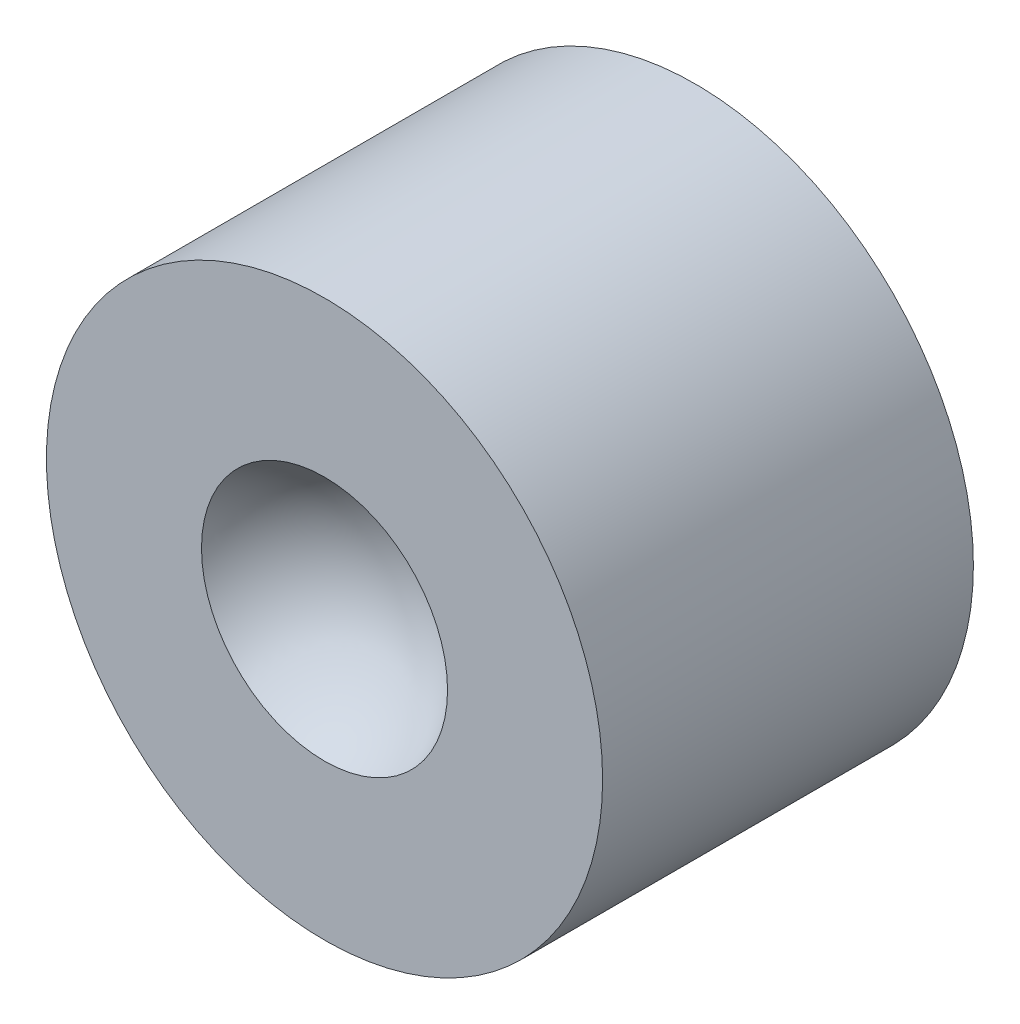
ISO-10303-21;
HEADER;
FILE_DESCRIPTION(('STEP AP214'),'2;1');
FILE_NAME('part.step','',(''),(''),'','','');
FILE_SCHEMA(('AUTOMOTIVE_DESIGN { 1 0 10303 214 1 1 1 1 }'));
ENDSEC;
DATA;
#1=APPLICATION_CONTEXT('core data for automotive mechanical design processes');
#2=APPLICATION_PROTOCOL_DEFINITION('international standard','automotive_design',2000,#1);
#3=PRODUCT_CONTEXT('',#1,'mechanical');
#4=PRODUCT('Part','Part','',(#3));
#5=PRODUCT_RELATED_PRODUCT_CATEGORY('part','',(#4));
#6=PRODUCT_DEFINITION_FORMATION('','',#4);
#7=PRODUCT_DEFINITION_CONTEXT('part definition',#1,'design');
#8=PRODUCT_DEFINITION('design','',#6,#7);
#9=PRODUCT_DEFINITION_SHAPE('','',#8);
#10=(LENGTH_UNIT() NAMED_UNIT(*) SI_UNIT(.MILLI.,.METRE.));
#11=(NAMED_UNIT(*) PLANE_ANGLE_UNIT() SI_UNIT($,.RADIAN.));
#12=(NAMED_UNIT(*) SI_UNIT($,.STERADIAN.) SOLID_ANGLE_UNIT());
#13=UNCERTAINTY_MEASURE_WITH_UNIT(LENGTH_MEASURE(1.E-05),#10,'distance_accuracy_value','');
#14=(GEOMETRIC_REPRESENTATION_CONTEXT(3) GLOBAL_UNCERTAINTY_ASSIGNED_CONTEXT((#13)) GLOBAL_UNIT_ASSIGNED_CONTEXT((#10,
#11,#12)) REPRESENTATION_CONTEXT('',''));
#15=CARTESIAN_POINT('',(0.,0.,0.));
#16=DIRECTION('',(0.,0.,1.));
#17=DIRECTION('',(1.,0.,0.));
#18=AXIS2_PLACEMENT_3D('',#15,#16,#17);
#19=CARTESIAN_POINT('',(0.,0.,6.35));
#20=DIRECTION('',(0.,0.,1.));
#21=DIRECTION('',(1.,0.,0.));
#22=AXIS2_PLACEMENT_3D('',#19,#20,#21);
#23=PLANE('',#22);
#24=CARTESIAN_POINT('',(0.,0.,6.35));
#25=DIRECTION('',(0.,0.,1.));
#26=DIRECTION('',(1.,0.,0.));
#27=AXIS2_PLACEMENT_3D('',#24,#25,#26);
#28=CIRCLE('',#27,4.7625);
#29=CARTESIAN_POINT('',(4.7625,0.,6.35));
#30=VERTEX_POINT('',#29);
#31=EDGE_CURVE('E11',#30,#30,#28,.T.);
#32=ORIENTED_EDGE('',*,*,#31,.T.);
#33=EDGE_LOOP('',(#32));
#34=FACE_BOUND('',#33,.T.);
#35=CARTESIAN_POINT('',(0.,0.,6.35));
#36=DIRECTION('',(0.,0.,-1.));
#37=DIRECTION('',(-1.,0.,0.));
#38=AXIS2_PLACEMENT_3D('',#35,#36,#37);
#39=CIRCLE('',#38,2.10693);
#40=CARTESIAN_POINT('',(-2.10693,0.,6.35));
#41=VERTEX_POINT('',#40);
#42=EDGE_CURVE('E49',#41,#41,#39,.T.);
#43=ORIENTED_EDGE('',*,*,#42,.T.);
#44=EDGE_LOOP('',(#43));
#45=FACE_BOUND('',#44,.T.);
#46=ADVANCED_FACE('F32',(#34,#45),#23,.T.);
#47=CARTESIAN_POINT('',(0.,0.,6.35));
#48=DIRECTION('',(0.,0.,-1.));
#49=DIRECTION('',(-1.,0.,0.));
#50=AXIS2_PLACEMENT_3D('',#47,#48,#49);
#51=CYLINDRICAL_SURFACE('',#50,4.7625);
#52=ORIENTED_EDGE('',*,*,#31,.F.);
#53=EDGE_LOOP('',(#52));
#54=FACE_BOUND('',#53,.T.);
#55=CARTESIAN_POINT('',(0.,0.,0.));
#56=DIRECTION('',(0.,0.,1.));
#57=DIRECTION('',(1.,0.,0.));
#58=AXIS2_PLACEMENT_3D('',#55,#56,#57);
#59=CIRCLE('',#58,4.7625);
#60=CARTESIAN_POINT('',(4.7625,0.,0.));
#61=VERTEX_POINT('',#60);
#62=EDGE_CURVE('E36',#61,#61,#59,.T.);
#63=ORIENTED_EDGE('',*,*,#62,.T.);
#64=EDGE_LOOP('',(#63));
#65=FACE_BOUND('',#64,.T.);
#66=ADVANCED_FACE('F34',(#54,#65),#51,.T.);
#67=CARTESIAN_POINT('',(0.,0.,0.));
#68=DIRECTION('',(0.,0.,1.));
#69=DIRECTION('',(1.,0.,0.));
#70=AXIS2_PLACEMENT_3D('',#67,#68,#69);
#71=PLANE('',#70);
#72=ORIENTED_EDGE('',*,*,#62,.F.);
#73=EDGE_LOOP('',(#72));
#74=FACE_BOUND('',#73,.T.);
#75=ADVANCED_FACE('F45',(#74),#71,.F.);
#76=CARTESIAN_POINT('',(-0.000873173653263186,0.,7.46124983990924));
#77=DIRECTION('',(0.,-1.,0.));
#78=DIRECTION('',(-1.,0.,0.));
#79=AXIS2_PLACEMENT_3D('',#76,#77,#78);
#80=CIRCLE('',#79,2.38125);
#81=TRIMMED_CURVE('',#80,(PARAMETER_VALUE(-1.5711630139016)),(PARAMETER_VALUE(1.5711630139016)),
.T.,.PARAMETER.);
#82=CARTESIAN_POINT('',(0.,0.,7.46124983990924));
#83=DIRECTION('',(0.,0.,-1.));
#84=AXIS1_PLACEMENT('',#82,#83);
#85=SURFACE_OF_REVOLUTION('',#81,#84);
#86=CARTESIAN_POINT('',(0.,0.,5.08));
#87=VERTEX_POINT('',#86);
#88=VERTEX_LOOP('',#87);
#89=FACE_BOUND('',#88,.T.);
#90=ORIENTED_EDGE('',*,*,#42,.F.);
#91=EDGE_LOOP('',(#90));
#92=FACE_BOUND('',#91,.T.);
#93=ADVANCED_FACE('F42',(#89,#92),#85,.F.);
#94=CLOSED_SHELL('',(#46,#66,#75,#93));
#95=MANIFOLD_SOLID_BREP('B2',#94);
#96=ADVANCED_BREP_SHAPE_REPRESENTATION('',(#18,#95),#14);
#97=SHAPE_DEFINITION_REPRESENTATION(#9,#96);
ENDSEC;
END-ISO-10303-21;
